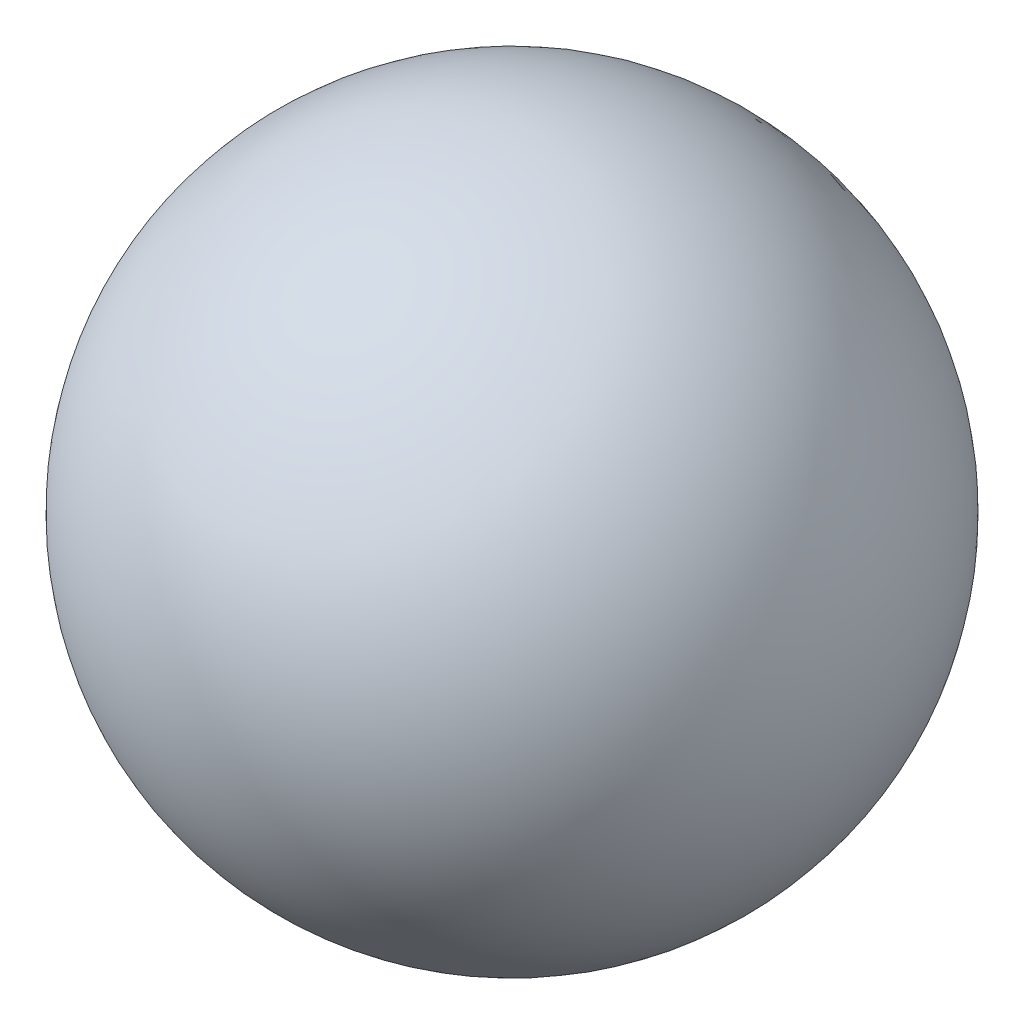
ISO-10303-21;
HEADER;
FILE_DESCRIPTION(('STEP AP214'),'2;1');
FILE_NAME('part.step','',(''),(''),'','','');
FILE_SCHEMA(('AUTOMOTIVE_DESIGN { 1 0 10303 214 1 1 1 1 }'));
ENDSEC;
DATA;
#1=APPLICATION_CONTEXT('core data for automotive mechanical design processes');
#2=APPLICATION_PROTOCOL_DEFINITION('international standard','automotive_design',2000,#1);
#3=PRODUCT_CONTEXT('',#1,'mechanical');
#4=PRODUCT('Part','Part','',(#3));
#5=PRODUCT_RELATED_PRODUCT_CATEGORY('part','',(#4));
#6=PRODUCT_DEFINITION_FORMATION('','',#4);
#7=PRODUCT_DEFINITION_CONTEXT('part definition',#1,'design');
#8=PRODUCT_DEFINITION('design','',#6,#7);
#9=PRODUCT_DEFINITION_SHAPE('','',#8);
#10=(LENGTH_UNIT() NAMED_UNIT(*) SI_UNIT(.MILLI.,.METRE.));
#11=(NAMED_UNIT(*) PLANE_ANGLE_UNIT() SI_UNIT($,.RADIAN.));
#12=(NAMED_UNIT(*) SI_UNIT($,.STERADIAN.) SOLID_ANGLE_UNIT());
#13=UNCERTAINTY_MEASURE_WITH_UNIT(LENGTH_MEASURE(1.E-05),#10,'distance_accuracy_value','');
#14=(GEOMETRIC_REPRESENTATION_CONTEXT(3) GLOBAL_UNCERTAINTY_ASSIGNED_CONTEXT((#13)) GLOBAL_UNIT_ASSIGNED_CONTEXT((#10,
#11,#12)) REPRESENTATION_CONTEXT('',''));
#15=CARTESIAN_POINT('',(0.,0.,0.));
#16=DIRECTION('',(0.,0.,1.));
#17=DIRECTION('',(1.,0.,0.));
#18=AXIS2_PLACEMENT_3D('',#15,#16,#17);
#19=CARTESIAN_POINT('',(64.16,-50.2923932754782,-47.7982831033149));
#20=DIRECTION('',(0.,-0.724851812050188,-0.68890481967218));
#21=DIRECTION('',(0.173648177666933,0.67843880750064,-0.713839684291973));
#22=AXIS2_PLACEMENT_3D('',#19,#20,#21);
#23=SPHERICAL_SURFACE('',#22,7.15);
#24=CARTESIAN_POINT('',(64.16,-45.1097028193194,-42.8726136426588));
#25=VERTEX_POINT('',#24);
#26=VERTEX_LOOP('',#25);
#27=FACE_BOUND('',#26,.T.);
#28=CARTESIAN_POINT('',(64.16,-55.475083731637,-52.723952563971));
#29=VERTEX_POINT('',#28);
#30=VERTEX_LOOP('',#29);
#31=FACE_BOUND('',#30,.T.);
#32=ADVANCED_FACE('F16',(#27,#31),#23,.T.);
#33=CLOSED_SHELL('',(#32));
#34=MANIFOLD_SOLID_BREP('B1',#33);
#35=ADVANCED_BREP_SHAPE_REPRESENTATION('',(#18,#34),#14);
#36=SHAPE_DEFINITION_REPRESENTATION(#9,#35);
ENDSEC;
END-ISO-10303-21;
